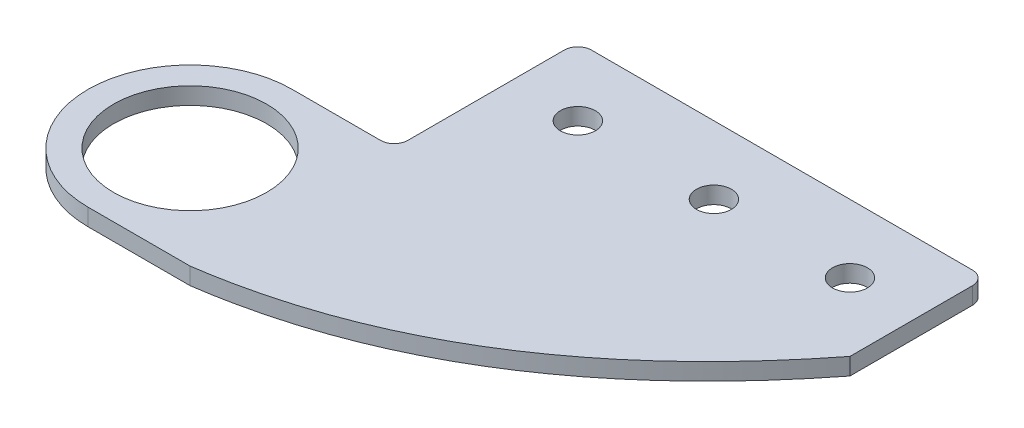
ISO-10303-21;
HEADER;
FILE_DESCRIPTION(('STEP AP214'),'2;1');
FILE_NAME('part.step','',(''),(''),'','','');
FILE_SCHEMA(('AUTOMOTIVE_DESIGN { 1 0 10303 214 1 1 1 1 }'));
ENDSEC;
DATA;
#1=APPLICATION_CONTEXT('core data for automotive mechanical design processes');
#2=APPLICATION_PROTOCOL_DEFINITION('international standard','automotive_design',2000,#1);
#3=PRODUCT_CONTEXT('',#1,'mechanical');
#4=PRODUCT('Part','Part','',(#3));
#5=PRODUCT_RELATED_PRODUCT_CATEGORY('part','',(#4));
#6=PRODUCT_DEFINITION_FORMATION('','',#4);
#7=PRODUCT_DEFINITION_CONTEXT('part definition',#1,'design');
#8=PRODUCT_DEFINITION('design','',#6,#7);
#9=PRODUCT_DEFINITION_SHAPE('','',#8);
#10=(LENGTH_UNIT() NAMED_UNIT(*) SI_UNIT(.MILLI.,.METRE.));
#11=(NAMED_UNIT(*) PLANE_ANGLE_UNIT() SI_UNIT($,.RADIAN.));
#12=(NAMED_UNIT(*) SI_UNIT($,.STERADIAN.) SOLID_ANGLE_UNIT());
#13=UNCERTAINTY_MEASURE_WITH_UNIT(LENGTH_MEASURE(1.E-05),#10,'distance_accuracy_value','');
#14=(GEOMETRIC_REPRESENTATION_CONTEXT(3) GLOBAL_UNCERTAINTY_ASSIGNED_CONTEXT((#13)) GLOBAL_UNIT_ASSIGNED_CONTEXT((#10,
#11,#12)) REPRESENTATION_CONTEXT('',''));
#15=CARTESIAN_POINT('',(0.,0.,0.));
#16=DIRECTION('',(0.,0.,1.));
#17=DIRECTION('',(1.,0.,0.));
#18=AXIS2_PLACEMENT_3D('',#15,#16,#17);
#19=CARTESIAN_POINT('',(38.1,3.175,19.8038025372828));
#20=CARTESIAN_POINT('',(6.35,3.175,60.4438025372828));
#21=CARTESIAN_POINT('',(-38.1,3.175,66.7938025372828));
#22=B_SPLINE_CURVE_WITH_KNOTS('',2,(#19,#20,#21),.UNSPECIFIED.,.F.,.F.,(3,3),(0.,1.),.UNSPECIFIED.);
#23=DIRECTION('',(0.,-1.,0.));
#24=VECTOR('',#23,1.);
#25=SURFACE_OF_LINEAR_EXTRUSION('',#22,#24);
#26=CARTESIAN_POINT('',(38.1,0.,19.8038025372828));
#27=CARTESIAN_POINT('',(6.35,0.,60.4438025372828));
#28=CARTESIAN_POINT('',(-38.1,0.,66.7938025372828));
#29=B_SPLINE_CURVE_WITH_KNOTS('',2,(#26,#27,#28),.UNSPECIFIED.,.F.,.F.,(3,3),(0.,1.),.UNSPECIFIED.);
#30=CARTESIAN_POINT('',(38.1,0.,19.8038025372828));
#31=VERTEX_POINT('',#30);
#32=CARTESIAN_POINT('',(-38.1,0.,66.7938025372828));
#33=VERTEX_POINT('',#32);
#34=EDGE_CURVE('E122',#31,#33,#29,.T.);
#35=ORIENTED_EDGE('',*,*,#34,.F.);
#36=DIRECTION('',(0.,-1.,0.));
#37=VECTOR('',#36,1.);
#38=CARTESIAN_POINT('',(38.1,3.175,19.8038025372828));
#39=LINE('',#38,#37);
#40=CARTESIAN_POINT('',(38.1,3.175,19.8038025372828));
#41=VERTEX_POINT('',#40);
#42=EDGE_CURVE('E118',#41,#31,#39,.T.);
#43=ORIENTED_EDGE('',*,*,#42,.F.);
#44=CARTESIAN_POINT('',(-38.1,3.175,66.7938025372828));
#45=VERTEX_POINT('',#44);
#46=EDGE_CURVE('E120',#41,#45,#22,.T.);
#47=ORIENTED_EDGE('',*,*,#46,.T.);
#48=DIRECTION('',(0.,-1.,0.));
#49=VECTOR('',#48,1.);
#50=CARTESIAN_POINT('',(-38.1,3.175,66.7938025372828));
#51=LINE('',#50,#49);
#52=EDGE_CURVE('E232',#45,#33,#51,.T.);
#53=ORIENTED_EDGE('',*,*,#52,.T.);
#54=EDGE_LOOP('',(#35,#43,#47,#53));
#55=FACE_BOUND('',#54,.T.);
#56=ADVANCED_FACE('F39',(#55),#25,.T.);
#57=CARTESIAN_POINT('',(38.1,3.175,0.));
#58=DIRECTION('',(-1.,0.,0.));
#59=DIRECTION('',(0.,0.,1.));
#60=AXIS2_PLACEMENT_3D('',#57,#58,#59);
#61=PLANE('',#60);
#62=DIRECTION('',(0.,0.,-1.));
#63=VECTOR('',#62,1.);
#64=CARTESIAN_POINT('',(38.1,0.,0.));
#65=LINE('',#64,#63);
#66=CARTESIAN_POINT('',(38.1,0.,-3.05619746271718));
#67=VERTEX_POINT('',#66);
#68=EDGE_CURVE('E213',#31,#67,#65,.T.);
#69=ORIENTED_EDGE('',*,*,#68,.T.);
#70=DIRECTION('',(0.,-1.,0.));
#71=VECTOR('',#70,1.);
#72=CARTESIAN_POINT('',(38.1,3.175,-3.05619746271718));
#73=LINE('',#72,#71);
#74=CARTESIAN_POINT('',(38.1,3.175,-3.05619746271718));
#75=VERTEX_POINT('',#74);
#76=EDGE_CURVE('E60',#67,#75,#73,.F.);
#77=ORIENTED_EDGE('',*,*,#76,.T.);
#78=DIRECTION('',(0.,0.,-1.));
#79=VECTOR('',#78,1.);
#80=CARTESIAN_POINT('',(38.1,3.175,0.));
#81=LINE('',#80,#79);
#82=EDGE_CURVE('E127',#41,#75,#81,.T.);
#83=ORIENTED_EDGE('',*,*,#82,.F.);
#84=ORIENTED_EDGE('',*,*,#42,.T.);
#85=EDGE_LOOP('',(#69,#77,#83,#84));
#86=FACE_BOUND('',#85,.T.);
#87=ADVANCED_FACE('F128',(#86),#61,.F.);
#88=CARTESIAN_POINT('',(0.,3.175,-5.59619746271718));
#89=DIRECTION('',(0.,0.,-1.));
#90=DIRECTION('',(-1.,0.,0.));
#91=AXIS2_PLACEMENT_3D('',#88,#89,#90);
#92=PLANE('',#91);
#93=DIRECTION('',(1.,0.,0.));
#94=VECTOR('',#93,1.);
#95=CARTESIAN_POINT('',(0.,0.,-5.59619746271718));
#96=LINE('',#95,#94);
#97=CARTESIAN_POINT('',(-35.56,0.,-5.59619746271718));
#98=VERTEX_POINT('',#97);
#99=CARTESIAN_POINT('',(35.56,0.,-5.59619746271718));
#100=VERTEX_POINT('',#99);
#101=EDGE_CURVE('E199',#98,#100,#96,.T.);
#102=ORIENTED_EDGE('',*,*,#101,.F.);
#103=DIRECTION('',(0.,-1.,0.));
#104=VECTOR('',#103,1.);
#105=CARTESIAN_POINT('',(-35.56,3.175,-5.59619746271718));
#106=LINE('',#105,#104);
#107=CARTESIAN_POINT('',(-35.56,3.175,-5.59619746271718));
#108=VERTEX_POINT('',#107);
#109=EDGE_CURVE('E173',#98,#108,#106,.F.);
#110=ORIENTED_EDGE('',*,*,#109,.T.);
#111=DIRECTION('',(1.,0.,0.));
#112=VECTOR('',#111,1.);
#113=CARTESIAN_POINT('',(0.,3.175,-5.59619746271718));
#114=LINE('',#113,#112);
#115=CARTESIAN_POINT('',(35.56,3.175,-5.59619746271718));
#116=VERTEX_POINT('',#115);
#117=EDGE_CURVE('E130',#108,#116,#114,.T.);
#118=ORIENTED_EDGE('',*,*,#117,.T.);
#119=DIRECTION('',(0.,-1.,0.));
#120=VECTOR('',#119,1.);
#121=CARTESIAN_POINT('',(35.56,0.,-5.59619746271718));
#122=LINE('',#121,#120);
#123=EDGE_CURVE('E170',#116,#100,#122,.T.);
#124=ORIENTED_EDGE('',*,*,#123,.T.);
#125=EDGE_LOOP('',(#102,#110,#118,#124));
#126=FACE_BOUND('',#125,.T.);
#127=ADVANCED_FACE('F211',(#126),#92,.T.);
#128=CARTESIAN_POINT('',(-38.1,3.175,0.));
#129=DIRECTION('',(1.,0.,0.));
#130=DIRECTION('',(0.,0.,-1.));
#131=AXIS2_PLACEMENT_3D('',#128,#129,#130);
#132=PLANE('',#131);
#133=DIRECTION('',(0.,0.,1.));
#134=VECTOR('',#133,1.);
#135=CARTESIAN_POINT('',(-38.1,3.175,0.));
#136=LINE('',#135,#134);
#137=CARTESIAN_POINT('',(-38.1,3.175,-3.05619746271718));
#138=VERTEX_POINT('',#137);
#139=CARTESIAN_POINT('',(-38.1,3.175,26.1538025372828));
#140=VERTEX_POINT('',#139);
#141=EDGE_CURVE('E250',#138,#140,#136,.T.);
#142=ORIENTED_EDGE('',*,*,#141,.F.);
#143=DIRECTION('',(0.,-1.,0.));
#144=VECTOR('',#143,1.);
#145=CARTESIAN_POINT('',(-38.1,0.,-3.05619746271718));
#146=LINE('',#145,#144);
#147=CARTESIAN_POINT('',(-38.1,0.,-3.05619746271718));
#148=VERTEX_POINT('',#147);
#149=EDGE_CURVE('E198',#138,#148,#146,.T.);
#150=ORIENTED_EDGE('',*,*,#149,.T.);
#151=DIRECTION('',(0.,0.,1.));
#152=VECTOR('',#151,1.);
#153=CARTESIAN_POINT('',(-38.1,0.,0.));
#154=LINE('',#153,#152);
#155=CARTESIAN_POINT('',(-38.1,0.,26.1538025372828));
#156=VERTEX_POINT('',#155);
#157=EDGE_CURVE('E187',#148,#156,#154,.T.);
#158=ORIENTED_EDGE('',*,*,#157,.T.);
#159=DIRECTION('',(0.,-1.,0.));
#160=VECTOR('',#159,1.);
#161=CARTESIAN_POINT('',(-38.1,3.175,26.1538025372828));
#162=LINE('',#161,#160);
#163=EDGE_CURVE('E124',#156,#140,#162,.F.);
#164=ORIENTED_EDGE('',*,*,#163,.T.);
#165=EDGE_LOOP('',(#142,#150,#158,#164));
#166=FACE_BOUND('',#165,.T.);
#167=ADVANCED_FACE('F196',(#166),#132,.F.);
#168=CARTESIAN_POINT('',(0.,3.175,28.6938025372828));
#169=DIRECTION('',(0.,0.,-1.));
#170=DIRECTION('',(-1.,0.,0.));
#171=AXIS2_PLACEMENT_3D('',#168,#169,#170);
#172=PLANE('',#171);
#173=DIRECTION('',(1.,0.,0.));
#174=VECTOR('',#173,1.);
#175=CARTESIAN_POINT('',(0.,3.175,28.6938025372828));
#176=LINE('',#175,#174);
#177=CARTESIAN_POINT('',(-57.15,3.175,28.6938025372828));
#178=VERTEX_POINT('',#177);
#179=CARTESIAN_POINT('',(-40.64,3.175,28.6938025372828));
#180=VERTEX_POINT('',#179);
#181=EDGE_CURVE('E248',#178,#180,#176,.T.);
#182=ORIENTED_EDGE('',*,*,#181,.T.);
#183=DIRECTION('',(0.,-1.,0.));
#184=VECTOR('',#183,1.);
#185=CARTESIAN_POINT('',(-40.64,3.175,28.6938025372828));
#186=LINE('',#185,#184);
#187=CARTESIAN_POINT('',(-40.64,0.,28.6938025372828));
#188=VERTEX_POINT('',#187);
#189=EDGE_CURVE('E180',#180,#188,#186,.T.);
#190=ORIENTED_EDGE('',*,*,#189,.T.);
#191=DIRECTION('',(1.,0.,0.));
#192=VECTOR('',#191,1.);
#193=CARTESIAN_POINT('',(0.,0.,28.6938025372828));
#194=LINE('',#193,#192);
#195=CARTESIAN_POINT('',(-57.15,0.,28.6938025372828));
#196=VERTEX_POINT('',#195);
#197=EDGE_CURVE('E190',#196,#188,#194,.T.);
#198=ORIENTED_EDGE('',*,*,#197,.F.);
#199=DIRECTION('',(0.,-1.,0.));
#200=VECTOR('',#199,1.);
#201=CARTESIAN_POINT('',(-57.15,3.175,28.6938025372828));
#202=LINE('',#201,#200);
#203=EDGE_CURVE('E125',#178,#196,#202,.T.);
#204=ORIENTED_EDGE('',*,*,#203,.F.);
#205=EDGE_LOOP('',(#182,#190,#198,#204));
#206=FACE_BOUND('',#205,.T.);
#207=ADVANCED_FACE('F242',(#206),#172,.T.);
#208=CARTESIAN_POINT('',(-57.15,3.175,47.7438025372828));
#209=DIRECTION('',(0.,-1.,0.));
#210=DIRECTION('',(0.,0.,-1.));
#211=AXIS2_PLACEMENT_3D('',#208,#209,#210);
#212=CYLINDRICAL_SURFACE('',#211,19.05);
#213=CARTESIAN_POINT('',(-57.15,0.,47.7438025372828));
#214=DIRECTION('',(0.,1.,0.));
#215=DIRECTION('',(0.,0.,1.));
#216=AXIS2_PLACEMENT_3D('',#213,#214,#215);
#217=CIRCLE('',#216,19.05);
#218=CARTESIAN_POINT('',(-57.15,0.,66.7938025372828));
#219=VERTEX_POINT('',#218);
#220=EDGE_CURVE('E219',#219,#196,#217,.F.);
#221=ORIENTED_EDGE('',*,*,#220,.F.);
#222=DIRECTION('',(0.,-1.,0.));
#223=VECTOR('',#222,1.);
#224=CARTESIAN_POINT('',(-57.15,3.175,66.7938025372828));
#225=LINE('',#224,#223);
#226=CARTESIAN_POINT('',(-57.15,3.175,66.7938025372828));
#227=VERTEX_POINT('',#226);
#228=EDGE_CURVE('E234',#227,#219,#225,.T.);
#229=ORIENTED_EDGE('',*,*,#228,.F.);
#230=CARTESIAN_POINT('',(-57.15,3.175,47.7438025372828));
#231=DIRECTION('',(0.,1.,0.));
#232=DIRECTION('',(0.,0.,1.));
#233=AXIS2_PLACEMENT_3D('',#230,#231,#232);
#234=CIRCLE('',#233,19.05);
#235=EDGE_CURVE('E240',#227,#178,#234,.F.);
#236=ORIENTED_EDGE('',*,*,#235,.T.);
#237=ORIENTED_EDGE('',*,*,#203,.T.);
#238=EDGE_LOOP('',(#221,#229,#236,#237));
#239=FACE_BOUND('',#238,.T.);
#240=ADVANCED_FACE('F239',(#239),#212,.T.);
#241=CARTESIAN_POINT('',(25.4,3.175,7.10380253728282));
#242=DIRECTION('',(0.,-1.,0.));
#243=DIRECTION('',(0.,0.,-1.));
#244=AXIS2_PLACEMENT_3D('',#241,#242,#243);
#245=CYLINDRICAL_SURFACE('',#244,3.2639);
#246=CARTESIAN_POINT('',(25.4,3.175,7.10380253728282));
#247=DIRECTION('',(0.,1.,0.));
#248=DIRECTION('',(0.,0.,1.));
#249=AXIS2_PLACEMENT_3D('',#246,#247,#248);
#250=CIRCLE('',#249,3.2639);
#251=CARTESIAN_POINT('',(25.4,3.175,10.3677025372828));
#252=VERTEX_POINT('',#251);
#253=EDGE_CURVE('E259',#252,#252,#250,.T.);
#254=ORIENTED_EDGE('',*,*,#253,.T.);
#255=EDGE_LOOP('',(#254));
#256=FACE_BOUND('',#255,.T.);
#257=CARTESIAN_POINT('',(25.4,0.,7.10380253728282));
#258=DIRECTION('',(0.,1.,0.));
#259=DIRECTION('',(0.,0.,1.));
#260=AXIS2_PLACEMENT_3D('',#257,#258,#259);
#261=CIRCLE('',#260,3.2639);
#262=CARTESIAN_POINT('',(25.4,0.,10.3677025372828));
#263=VERTEX_POINT('',#262);
#264=EDGE_CURVE('E142',#263,#263,#261,.T.);
#265=ORIENTED_EDGE('',*,*,#264,.F.);
#266=EDGE_LOOP('',(#265));
#267=FACE_BOUND('',#266,.T.);
#268=ADVANCED_FACE('F282',(#256,#267),#245,.F.);
#269=CARTESIAN_POINT('',(0.,3.175,7.10380253728282));
#270=DIRECTION('',(0.,-1.,0.));
#271=DIRECTION('',(0.,0.,-1.));
#272=AXIS2_PLACEMENT_3D('',#269,#270,#271);
#273=CYLINDRICAL_SURFACE('',#272,3.2639);
#274=CARTESIAN_POINT('',(0.,3.175,7.10380253728282));
#275=DIRECTION('',(0.,1.,0.));
#276=DIRECTION('',(0.,0.,1.));
#277=AXIS2_PLACEMENT_3D('',#274,#275,#276);
#278=CIRCLE('',#277,3.2639);
#279=CARTESIAN_POINT('',(0.,3.175,10.3677025372828));
#280=VERTEX_POINT('',#279);
#281=EDGE_CURVE('E256',#280,#280,#278,.T.);
#282=ORIENTED_EDGE('',*,*,#281,.T.);
#283=EDGE_LOOP('',(#282));
#284=FACE_BOUND('',#283,.T.);
#285=CARTESIAN_POINT('',(0.,0.,7.10380253728282));
#286=DIRECTION('',(0.,1.,0.));
#287=DIRECTION('',(0.,0.,1.));
#288=AXIS2_PLACEMENT_3D('',#285,#286,#287);
#289=CIRCLE('',#288,3.2639);
#290=CARTESIAN_POINT('',(0.,0.,10.3677025372828));
#291=VERTEX_POINT('',#290);
#292=EDGE_CURVE('E227',#291,#291,#289,.T.);
#293=ORIENTED_EDGE('',*,*,#292,.F.);
#294=EDGE_LOOP('',(#293));
#295=FACE_BOUND('',#294,.T.);
#296=ADVANCED_FACE('F285',(#284,#295),#273,.F.);
#297=CARTESIAN_POINT('',(-25.4,3.175,7.10380253728282));
#298=DIRECTION('',(0.,-1.,0.));
#299=DIRECTION('',(0.,0.,-1.));
#300=AXIS2_PLACEMENT_3D('',#297,#298,#299);
#301=CYLINDRICAL_SURFACE('',#300,3.2639);
#302=CARTESIAN_POINT('',(-25.4,3.175,7.10380253728282));
#303=DIRECTION('',(0.,1.,0.));
#304=DIRECTION('',(0.,0.,1.));
#305=AXIS2_PLACEMENT_3D('',#302,#303,#304);
#306=CIRCLE('',#305,3.2639);
#307=CARTESIAN_POINT('',(-25.4,3.175,10.3677025372828));
#308=VERTEX_POINT('',#307);
#309=EDGE_CURVE('E246',#308,#308,#306,.T.);
#310=ORIENTED_EDGE('',*,*,#309,.T.);
#311=EDGE_LOOP('',(#310));
#312=FACE_BOUND('',#311,.T.);
#313=CARTESIAN_POINT('',(-25.4,0.,7.10380253728282));
#314=DIRECTION('',(0.,1.,0.));
#315=DIRECTION('',(0.,0.,1.));
#316=AXIS2_PLACEMENT_3D('',#313,#314,#315);
#317=CIRCLE('',#316,3.2639);
#318=CARTESIAN_POINT('',(-25.4,0.,10.3677025372828));
#319=VERTEX_POINT('',#318);
#320=EDGE_CURVE('E224',#319,#319,#317,.T.);
#321=ORIENTED_EDGE('',*,*,#320,.F.);
#322=EDGE_LOOP('',(#321));
#323=FACE_BOUND('',#322,.T.);
#324=ADVANCED_FACE('F289',(#312,#323),#301,.F.);
#325=CARTESIAN_POINT('',(0.,3.175,66.7938025372828));
#326=DIRECTION('',(0.,0.,-1.));
#327=DIRECTION('',(-1.,0.,0.));
#328=AXIS2_PLACEMENT_3D('',#325,#326,#327);
#329=PLANE('',#328);
#330=DIRECTION('',(1.,0.,0.));
#331=VECTOR('',#330,1.);
#332=CARTESIAN_POINT('',(0.,0.,66.7938025372828));
#333=LINE('',#332,#331);
#334=EDGE_CURVE('E221',#219,#33,#333,.T.);
#335=ORIENTED_EDGE('',*,*,#334,.T.);
#336=ORIENTED_EDGE('',*,*,#52,.F.);
#337=DIRECTION('',(1.,0.,0.));
#338=VECTOR('',#337,1.);
#339=CARTESIAN_POINT('',(0.,3.175,66.7938025372828));
#340=LINE('',#339,#338);
#341=EDGE_CURVE('E137',#227,#45,#340,.T.);
#342=ORIENTED_EDGE('',*,*,#341,.F.);
#343=ORIENTED_EDGE('',*,*,#228,.T.);
#344=EDGE_LOOP('',(#335,#336,#342,#343));
#345=FACE_BOUND('',#344,.T.);
#346=ADVANCED_FACE('F245',(#345),#329,.F.);
#347=CARTESIAN_POINT('',(-57.15,3.175,47.7438025372828));
#348=DIRECTION('',(0.,-1.,0.));
#349=DIRECTION('',(0.,0.,-1.));
#350=AXIS2_PLACEMENT_3D('',#347,#348,#349);
#351=CYLINDRICAL_SURFACE('',#350,14.2875);
#352=CARTESIAN_POINT('',(-57.15,3.175,47.7438025372828));
#353=DIRECTION('',(0.,1.,0.));
#354=DIRECTION('',(0.,0.,1.));
#355=AXIS2_PLACEMENT_3D('',#352,#353,#354);
#356=CIRCLE('',#355,14.2875);
#357=CARTESIAN_POINT('',(-57.15,3.175,62.0313025372828));
#358=VERTEX_POINT('',#357);
#359=EDGE_CURVE('E235',#358,#358,#356,.T.);
#360=ORIENTED_EDGE('',*,*,#359,.T.);
#361=EDGE_LOOP('',(#360));
#362=FACE_BOUND('',#361,.T.);
#363=CARTESIAN_POINT('',(-57.15,0.,47.7438025372828));
#364=DIRECTION('',(0.,1.,0.));
#365=DIRECTION('',(0.,0.,1.));
#366=AXIS2_PLACEMENT_3D('',#363,#364,#365);
#367=CIRCLE('',#366,14.2875);
#368=CARTESIAN_POINT('',(-57.15,0.,62.0313025372828));
#369=VERTEX_POINT('',#368);
#370=EDGE_CURVE('E139',#369,#369,#367,.T.);
#371=ORIENTED_EDGE('',*,*,#370,.F.);
#372=EDGE_LOOP('',(#371));
#373=FACE_BOUND('',#372,.T.);
#374=ADVANCED_FACE('F270',(#362,#373),#351,.F.);
#375=CARTESIAN_POINT('',(0.,3.175,0.));
#376=DIRECTION('',(0.,1.,0.));
#377=DIRECTION('',(0.,0.,1.));
#378=AXIS2_PLACEMENT_3D('',#375,#376,#377);
#379=PLANE('',#378);
#380=ORIENTED_EDGE('',*,*,#117,.F.);
#381=CARTESIAN_POINT('',(-35.56,3.175,-3.05619746271718));
#382=DIRECTION('',(0.,1.,0.));
#383=DIRECTION('',(0.,0.,1.));
#384=AXIS2_PLACEMENT_3D('',#381,#382,#383);
#385=CIRCLE('',#384,2.54);
#386=EDGE_CURVE('E172',#108,#138,#385,.T.);
#387=ORIENTED_EDGE('',*,*,#386,.T.);
#388=ORIENTED_EDGE('',*,*,#141,.T.);
#389=CARTESIAN_POINT('',(-40.64,3.175,26.1538025372828));
#390=DIRECTION('',(0.,1.,0.));
#391=DIRECTION('',(0.,0.,1.));
#392=AXIS2_PLACEMENT_3D('',#389,#390,#391);
#393=CIRCLE('',#392,2.54);
#394=EDGE_CURVE('E11',#140,#180,#393,.F.);
#395=ORIENTED_EDGE('',*,*,#394,.T.);
#396=ORIENTED_EDGE('',*,*,#181,.F.);
#397=ORIENTED_EDGE('',*,*,#235,.F.);
#398=ORIENTED_EDGE('',*,*,#341,.T.);
#399=ORIENTED_EDGE('',*,*,#46,.F.);
#400=ORIENTED_EDGE('',*,*,#82,.T.);
#401=CARTESIAN_POINT('',(35.56,3.175,-3.05619746271718));
#402=DIRECTION('',(0.,1.,0.));
#403=DIRECTION('',(0.,0.,1.));
#404=AXIS2_PLACEMENT_3D('',#401,#402,#403);
#405=CIRCLE('',#404,2.54);
#406=EDGE_CURVE('E168',#75,#116,#405,.T.);
#407=ORIENTED_EDGE('',*,*,#406,.T.);
#408=EDGE_LOOP('',(#380,#387,#388,#395,#396,#397,#398,#399,#400,#407));
#409=FACE_BOUND('',#408,.T.);
#410=ORIENTED_EDGE('',*,*,#309,.F.);
#411=EDGE_LOOP('',(#410));
#412=FACE_BOUND('',#411,.T.);
#413=ORIENTED_EDGE('',*,*,#281,.F.);
#414=EDGE_LOOP('',(#413));
#415=FACE_BOUND('',#414,.T.);
#416=ORIENTED_EDGE('',*,*,#253,.F.);
#417=EDGE_LOOP('',(#416));
#418=FACE_BOUND('',#417,.T.);
#419=ORIENTED_EDGE('',*,*,#359,.F.);
#420=EDGE_LOOP('',(#419));
#421=FACE_BOUND('',#420,.T.);
#422=ADVANCED_FACE('F133',(#409,#412,#415,#418,#421),#379,.T.);
#423=CARTESIAN_POINT('',(0.,0.,0.));
#424=DIRECTION('',(0.,1.,0.));
#425=DIRECTION('',(0.,0.,1.));
#426=AXIS2_PLACEMENT_3D('',#423,#424,#425);
#427=PLANE('',#426);
#428=ORIENTED_EDGE('',*,*,#157,.F.);
#429=CARTESIAN_POINT('',(-35.56,0.,-3.05619746271718));
#430=DIRECTION('',(0.,1.,0.));
#431=DIRECTION('',(0.,0.,1.));
#432=AXIS2_PLACEMENT_3D('',#429,#430,#431);
#433=CIRCLE('',#432,2.54);
#434=EDGE_CURVE('E207',#148,#98,#433,.F.);
#435=ORIENTED_EDGE('',*,*,#434,.T.);
#436=ORIENTED_EDGE('',*,*,#101,.T.);
#437=CARTESIAN_POINT('',(35.56,0.,-3.05619746271718));
#438=DIRECTION('',(0.,1.,0.));
#439=DIRECTION('',(0.,0.,1.));
#440=AXIS2_PLACEMENT_3D('',#437,#438,#439);
#441=CIRCLE('',#440,2.54);
#442=EDGE_CURVE('E202',#100,#67,#441,.F.);
#443=ORIENTED_EDGE('',*,*,#442,.T.);
#444=ORIENTED_EDGE('',*,*,#68,.F.);
#445=ORIENTED_EDGE('',*,*,#34,.T.);
#446=ORIENTED_EDGE('',*,*,#334,.F.);
#447=ORIENTED_EDGE('',*,*,#220,.T.);
#448=ORIENTED_EDGE('',*,*,#197,.T.);
#449=CARTESIAN_POINT('',(-40.64,0.,26.1538025372828));
#450=DIRECTION('',(0.,1.,0.));
#451=DIRECTION('',(0.,0.,1.));
#452=AXIS2_PLACEMENT_3D('',#449,#450,#451);
#453=CIRCLE('',#452,2.54);
#454=EDGE_CURVE('E47',#188,#156,#453,.T.);
#455=ORIENTED_EDGE('',*,*,#454,.T.);
#456=EDGE_LOOP('',(#428,#435,#436,#443,#444,#445,#446,#447,#448,#455));
#457=FACE_BOUND('',#456,.T.);
#458=ORIENTED_EDGE('',*,*,#320,.T.);
#459=EDGE_LOOP('',(#458));
#460=FACE_BOUND('',#459,.T.);
#461=ORIENTED_EDGE('',*,*,#292,.T.);
#462=EDGE_LOOP('',(#461));
#463=FACE_BOUND('',#462,.T.);
#464=ORIENTED_EDGE('',*,*,#264,.T.);
#465=EDGE_LOOP('',(#464));
#466=FACE_BOUND('',#465,.T.);
#467=ORIENTED_EDGE('',*,*,#370,.T.);
#468=EDGE_LOOP('',(#467));
#469=FACE_BOUND('',#468,.T.);
#470=ADVANCED_FACE('F159',(#457,#460,#463,#466,#469),#427,.F.);
#471=CARTESIAN_POINT('',(-35.56,3.175,-3.05619746271718));
#472=DIRECTION('',(0.,1.,0.));
#473=DIRECTION('',(0.,0.,1.));
#474=AXIS2_PLACEMENT_3D('',#471,#472,#473);
#475=CYLINDRICAL_SURFACE('',#474,2.54);
#476=ORIENTED_EDGE('',*,*,#386,.F.);
#477=ORIENTED_EDGE('',*,*,#109,.F.);
#478=ORIENTED_EDGE('',*,*,#434,.F.);
#479=ORIENTED_EDGE('',*,*,#149,.F.);
#480=EDGE_LOOP('',(#476,#477,#478,#479));
#481=FACE_BOUND('',#480,.T.);
#482=ADVANCED_FACE('F156',(#481),#475,.T.);
#483=CARTESIAN_POINT('',(35.56,3.175,-3.05619746271718));
#484=DIRECTION('',(0.,1.,0.));
#485=DIRECTION('',(0.,0.,1.));
#486=AXIS2_PLACEMENT_3D('',#483,#484,#485);
#487=CYLINDRICAL_SURFACE('',#486,2.54);
#488=ORIENTED_EDGE('',*,*,#406,.F.);
#489=ORIENTED_EDGE('',*,*,#76,.F.);
#490=ORIENTED_EDGE('',*,*,#442,.F.);
#491=ORIENTED_EDGE('',*,*,#123,.F.);
#492=EDGE_LOOP('',(#488,#489,#490,#491));
#493=FACE_BOUND('',#492,.T.);
#494=ADVANCED_FACE('F158',(#493),#487,.T.);
#495=CARTESIAN_POINT('',(-40.64,3.175,26.1538025372828));
#496=DIRECTION('',(0.,-1.,0.));
#497=DIRECTION('',(0.,0.,-1.));
#498=AXIS2_PLACEMENT_3D('',#495,#496,#497);
#499=CYLINDRICAL_SURFACE('',#498,2.54);
#500=ORIENTED_EDGE('',*,*,#394,.F.);
#501=ORIENTED_EDGE('',*,*,#163,.F.);
#502=ORIENTED_EDGE('',*,*,#454,.F.);
#503=ORIENTED_EDGE('',*,*,#189,.F.);
#504=EDGE_LOOP('',(#500,#501,#502,#503));
#505=FACE_BOUND('',#504,.T.);
#506=ADVANCED_FACE('F41',(#505),#499,.F.);
#507=CLOSED_SHELL('',(#56,#87,#127,#167,#207,#240,#268,#296,#324,#346,#374,#422,#470,#482,#494,#506));
#508=MANIFOLD_SOLID_BREP('B2',#507);
#509=ADVANCED_BREP_SHAPE_REPRESENTATION('',(#18,#508),#14);
#510=SHAPE_DEFINITION_REPRESENTATION(#9,#509);
ENDSEC;
END-ISO-10303-21;
